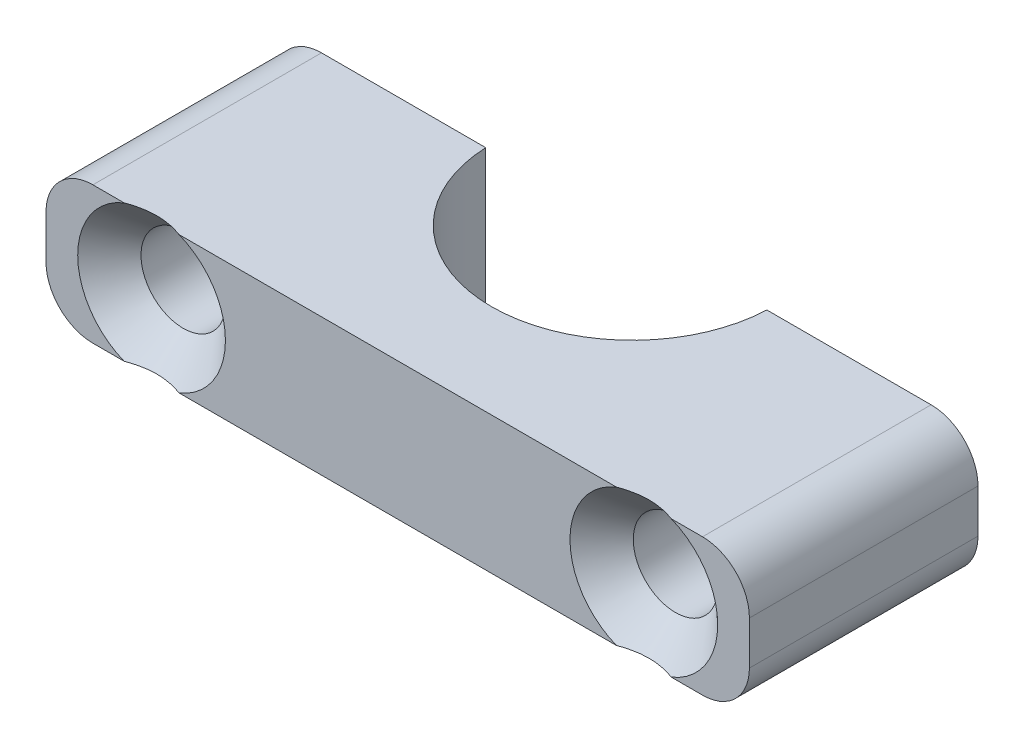
ISO-10303-21;
HEADER;
FILE_DESCRIPTION(('STEP AP214'),'2;1');
FILE_NAME('part.step','',(''),(''),'','','');
FILE_SCHEMA(('AUTOMOTIVE_DESIGN { 1 0 10303 214 1 1 1 1 }'));
ENDSEC;
DATA;
#1=APPLICATION_CONTEXT('core data for automotive mechanical design processes');
#2=APPLICATION_PROTOCOL_DEFINITION('international standard','automotive_design',2000,#1);
#3=PRODUCT_CONTEXT('',#1,'mechanical');
#4=PRODUCT('Part','Part','',(#3));
#5=PRODUCT_RELATED_PRODUCT_CATEGORY('part','',(#4));
#6=PRODUCT_DEFINITION_FORMATION('','',#4);
#7=PRODUCT_DEFINITION_CONTEXT('part definition',#1,'design');
#8=PRODUCT_DEFINITION('design','',#6,#7);
#9=PRODUCT_DEFINITION_SHAPE('','',#8);
#10=(LENGTH_UNIT() NAMED_UNIT(*) SI_UNIT(.MILLI.,.METRE.));
#11=(NAMED_UNIT(*) PLANE_ANGLE_UNIT() SI_UNIT($,.RADIAN.));
#12=(NAMED_UNIT(*) SI_UNIT($,.STERADIAN.) SOLID_ANGLE_UNIT());
#13=UNCERTAINTY_MEASURE_WITH_UNIT(LENGTH_MEASURE(1.E-05),#10,'distance_accuracy_value','');
#14=(GEOMETRIC_REPRESENTATION_CONTEXT(3) GLOBAL_UNCERTAINTY_ASSIGNED_CONTEXT((#13)) GLOBAL_UNIT_ASSIGNED_CONTEXT((#10,
#11,#12)) REPRESENTATION_CONTEXT('',''));
#15=CARTESIAN_POINT('',(0.,0.,0.));
#16=DIRECTION('',(0.,0.,1.));
#17=DIRECTION('',(1.,0.,0.));
#18=AXIS2_PLACEMENT_3D('',#15,#16,#17);
#19=CARTESIAN_POINT('',(0.,2.925,4.875));
#20=DIRECTION('',(0.,0.,1.));
#21=DIRECTION('',(1.,0.,0.));
#22=AXIS2_PLACEMENT_3D('',#19,#20,#21);
#23=PLANE('',#22);
#24=DIRECTION('',(0.,-1.,0.));
#25=VECTOR('',#24,1.);
#26=CARTESIAN_POINT('',(-15.,2.925,4.875));
#27=LINE('',#26,#25);
#28=CARTESIAN_POINT('',(-15.,0.925,4.875));
#29=VERTEX_POINT('',#28);
#30=CARTESIAN_POINT('',(-15.,-0.925,4.875));
#31=VERTEX_POINT('',#30);
#32=EDGE_CURVE('E279',#29,#31,#27,.T.);
#33=ORIENTED_EDGE('',*,*,#32,.T.);
#34=CARTESIAN_POINT('',(-13.,-0.925,4.875));
#35=DIRECTION('',(0.,0.,1.));
#36=DIRECTION('',(1.,0.,0.));
#37=AXIS2_PLACEMENT_3D('',#34,#35,#36);
#38=CIRCLE('',#37,2.);
#39=CARTESIAN_POINT('',(-13.,-2.925,4.875));
#40=VERTEX_POINT('',#39);
#41=EDGE_CURVE('E322',#31,#40,#38,.T.);
#42=ORIENTED_EDGE('',*,*,#41,.T.);
#43=DIRECTION('',(-1.,0.,0.));
#44=VECTOR('',#43,1.);
#45=CARTESIAN_POINT('',(0.,-2.925,4.875));
#46=LINE('',#45,#44);
#47=CARTESIAN_POINT('',(-11.6665289971794,-2.925,4.875));
#48=VERTEX_POINT('',#47);
#49=EDGE_CURVE('E161',#48,#40,#46,.T.);
#50=ORIENTED_EDGE('',*,*,#49,.F.);
#51=CARTESIAN_POINT('',(-10.4973947020705,0.,4.875));
#52=DIRECTION('',(0.,0.,1.));
#53=DIRECTION('',(1.,0.,0.));
#54=AXIS2_PLACEMENT_3D('',#51,#52,#53);
#55=CIRCLE('',#54,3.15);
#56=CARTESIAN_POINT('',(-11.6665289971794,2.925,4.875));
#57=VERTEX_POINT('',#56);
#58=EDGE_CURVE('E147',#57,#48,#55,.T.);
#59=ORIENTED_EDGE('',*,*,#58,.F.);
#60=DIRECTION('',(-1.,0.,0.));
#61=VECTOR('',#60,1.);
#62=CARTESIAN_POINT('',(0.,2.925,4.875));
#63=LINE('',#62,#61);
#64=CARTESIAN_POINT('',(-13.,2.925,4.875));
#65=VERTEX_POINT('',#64);
#66=EDGE_CURVE('E158',#57,#65,#63,.T.);
#67=ORIENTED_EDGE('',*,*,#66,.T.);
#68=CARTESIAN_POINT('',(-13.,0.925,4.875));
#69=DIRECTION('',(0.,0.,1.));
#70=DIRECTION('',(1.,0.,0.));
#71=AXIS2_PLACEMENT_3D('',#68,#69,#70);
#72=CIRCLE('',#71,2.);
#73=EDGE_CURVE('E320',#65,#29,#72,.T.);
#74=ORIENTED_EDGE('',*,*,#73,.T.);
#75=EDGE_LOOP('',(#33,#42,#50,#59,#67,#74));
#76=FACE_BOUND('',#75,.T.);
#77=ADVANCED_FACE('F41',(#76),#23,.T.);
#78=CARTESIAN_POINT('',(-9.32826040696145,-2.925,4.875));
#79=VERTEX_POINT('',#78);
#80=CARTESIAN_POINT('',(-9.32826040696146,2.925,4.875));
#81=VERTEX_POINT('',#80);
#82=EDGE_CURVE('E150',#79,#81,#55,.T.);
#83=ORIENTED_EDGE('',*,*,#82,.F.);
#84=CARTESIAN_POINT('',(9.32826040696145,-2.925,4.875));
#85=VERTEX_POINT('',#84);
#86=EDGE_CURVE('E265',#85,#79,#46,.T.);
#87=ORIENTED_EDGE('',*,*,#86,.F.);
#88=CARTESIAN_POINT('',(10.4973947020705,0.,4.875));
#89=DIRECTION('',(0.,0.,1.));
#90=DIRECTION('',(1.,0.,0.));
#91=AXIS2_PLACEMENT_3D('',#88,#89,#90);
#92=CIRCLE('',#91,3.15);
#93=CARTESIAN_POINT('',(9.32826040696146,2.925,4.875));
#94=VERTEX_POINT('',#93);
#95=EDGE_CURVE('E244',#94,#85,#92,.T.);
#96=ORIENTED_EDGE('',*,*,#95,.F.);
#97=EDGE_CURVE('E166',#94,#81,#63,.T.);
#98=ORIENTED_EDGE('',*,*,#97,.T.);
#99=EDGE_LOOP('',(#83,#87,#96,#98));
#100=FACE_BOUND('',#99,.T.);
#101=ADVANCED_FACE('F269',(#100),#23,.T.);
#102=CARTESIAN_POINT('',(0.,2.925,-5.125));
#103=DIRECTION('',(0.,-1.,0.));
#104=DIRECTION('',(0.,0.,-1.));
#105=AXIS2_PLACEMENT_3D('',#102,#103,#104);
#106=CYLINDRICAL_SURFACE('',#105,6.);
#107=CARTESIAN_POINT('',(0.,-2.925,-5.125));
#108=DIRECTION('',(0.,1.,0.));
#109=DIRECTION('',(0.,0.,1.));
#110=AXIS2_PLACEMENT_3D('',#107,#108,#109);
#111=CIRCLE('',#110,6.);
#112=CARTESIAN_POINT('',(-5.9947894041409,-2.925,-4.875));
#113=VERTEX_POINT('',#112);
#114=CARTESIAN_POINT('',(5.9947894041409,-2.925,-4.875));
#115=VERTEX_POINT('',#114);
#116=EDGE_CURVE('E199',#113,#115,#111,.T.);
#117=ORIENTED_EDGE('',*,*,#116,.F.);
#118=DIRECTION('',(0.,-1.,0.));
#119=VECTOR('',#118,1.);
#120=CARTESIAN_POINT('',(-5.9947894041409,2.925,-4.875));
#121=LINE('',#120,#119);
#122=CARTESIAN_POINT('',(-5.9947894041409,2.925,-4.875));
#123=VERTEX_POINT('',#122);
#124=EDGE_CURVE('E268',#123,#113,#121,.T.);
#125=ORIENTED_EDGE('',*,*,#124,.F.);
#126=CARTESIAN_POINT('',(0.,2.925,-5.125));
#127=DIRECTION('',(0.,1.,0.));
#128=DIRECTION('',(0.,0.,1.));
#129=AXIS2_PLACEMENT_3D('',#126,#127,#128);
#130=CIRCLE('',#129,6.);
#131=CARTESIAN_POINT('',(5.9947894041409,2.925,-4.875));
#132=VERTEX_POINT('',#131);
#133=EDGE_CURVE('E172',#123,#132,#130,.T.);
#134=ORIENTED_EDGE('',*,*,#133,.T.);
#135=DIRECTION('',(0.,-1.,0.));
#136=VECTOR('',#135,1.);
#137=CARTESIAN_POINT('',(5.9947894041409,2.925,-4.875));
#138=LINE('',#137,#136);
#139=EDGE_CURVE('E179',#132,#115,#138,.T.);
#140=ORIENTED_EDGE('',*,*,#139,.T.);
#141=EDGE_LOOP('',(#117,#125,#134,#140));
#142=FACE_BOUND('',#141,.T.);
#143=ADVANCED_FACE('F293',(#142),#106,.F.);
#144=CARTESIAN_POINT('',(0.,2.925,-4.875));
#145=DIRECTION('',(0.,0.,1.));
#146=DIRECTION('',(1.,0.,0.));
#147=AXIS2_PLACEMENT_3D('',#144,#145,#146);
#148=PLANE('',#147);
#149=CARTESIAN_POINT('',(-10.4973947020705,0.,-4.875));
#150=DIRECTION('',(0.,0.,1.));
#151=DIRECTION('',(1.,0.,0.));
#152=AXIS2_PLACEMENT_3D('',#149,#150,#151);
#153=CIRCLE('',#152,1.8);
#154=CARTESIAN_POINT('',(-8.69739470207045,0.,-4.875));
#155=VERTEX_POINT('',#154);
#156=EDGE_CURVE('E242',#155,#155,#153,.T.);
#157=ORIENTED_EDGE('',*,*,#156,.T.);
#158=EDGE_LOOP('',(#157));
#159=FACE_BOUND('',#158,.T.);
#160=DIRECTION('',(-1.,0.,0.));
#161=VECTOR('',#160,1.);
#162=CARTESIAN_POINT('',(0.,-2.925,-4.875));
#163=LINE('',#162,#161);
#164=CARTESIAN_POINT('',(-13.,-2.925,-4.875));
#165=VERTEX_POINT('',#164);
#166=EDGE_CURVE('E271',#113,#165,#163,.T.);
#167=ORIENTED_EDGE('',*,*,#166,.T.);
#168=CARTESIAN_POINT('',(-13.,-0.925,-4.875));
#169=DIRECTION('',(0.,0.,1.));
#170=DIRECTION('',(1.,0.,0.));
#171=AXIS2_PLACEMENT_3D('',#168,#169,#170);
#172=CIRCLE('',#171,2.);
#173=CARTESIAN_POINT('',(-15.,-0.925,-4.875));
#174=VERTEX_POINT('',#173);
#175=EDGE_CURVE('E314',#165,#174,#172,.F.);
#176=ORIENTED_EDGE('',*,*,#175,.T.);
#177=DIRECTION('',(0.,-1.,0.));
#178=VECTOR('',#177,1.);
#179=CARTESIAN_POINT('',(-15.,2.925,-4.875));
#180=LINE('',#179,#178);
#181=CARTESIAN_POINT('',(-15.,0.925,-4.875));
#182=VERTEX_POINT('',#181);
#183=EDGE_CURVE('E281',#182,#174,#180,.T.);
#184=ORIENTED_EDGE('',*,*,#183,.F.);
#185=CARTESIAN_POINT('',(-13.,0.925,-4.875));
#186=DIRECTION('',(0.,0.,1.));
#187=DIRECTION('',(1.,0.,0.));
#188=AXIS2_PLACEMENT_3D('',#185,#186,#187);
#189=CIRCLE('',#188,2.);
#190=CARTESIAN_POINT('',(-13.,2.925,-4.875));
#191=VERTEX_POINT('',#190);
#192=EDGE_CURVE('E312',#182,#191,#189,.F.);
#193=ORIENTED_EDGE('',*,*,#192,.T.);
#194=DIRECTION('',(-1.,0.,0.));
#195=VECTOR('',#194,1.);
#196=CARTESIAN_POINT('',(0.,2.925,-4.875));
#197=LINE('',#196,#195);
#198=EDGE_CURVE('E167',#123,#191,#197,.T.);
#199=ORIENTED_EDGE('',*,*,#198,.F.);
#200=ORIENTED_EDGE('',*,*,#124,.T.);
#201=EDGE_LOOP('',(#167,#176,#184,#193,#199,#200));
#202=FACE_BOUND('',#201,.T.);
#203=ADVANCED_FACE('F286',(#159,#202),#148,.F.);
#204=CARTESIAN_POINT('',(-15.,2.925,0.));
#205=DIRECTION('',(-1.,0.,0.));
#206=DIRECTION('',(0.,0.,1.));
#207=AXIS2_PLACEMENT_3D('',#204,#205,#206);
#208=PLANE('',#207);
#209=ORIENTED_EDGE('',*,*,#183,.T.);
#210=DIRECTION('',(0.,0.,-1.));
#211=VECTOR('',#210,1.);
#212=CARTESIAN_POINT('',(-15.,-0.925,4.875));
#213=LINE('',#212,#211);
#214=EDGE_CURVE('E63',#174,#31,#213,.F.);
#215=ORIENTED_EDGE('',*,*,#214,.T.);
#216=ORIENTED_EDGE('',*,*,#32,.F.);
#217=DIRECTION('',(0.,0.,-1.));
#218=VECTOR('',#217,1.);
#219=CARTESIAN_POINT('',(-15.,0.925,0.));
#220=LINE('',#219,#218);
#221=EDGE_CURVE('E316',#29,#182,#220,.T.);
#222=ORIENTED_EDGE('',*,*,#221,.T.);
#223=EDGE_LOOP('',(#209,#215,#216,#222));
#224=FACE_BOUND('',#223,.T.);
#225=ADVANCED_FACE('F327',(#224),#208,.T.);
#226=CARTESIAN_POINT('',(13.,-2.925,4.875));
#227=VERTEX_POINT('',#226);
#228=CARTESIAN_POINT('',(11.6665289971794,-2.925,4.875));
#229=VERTEX_POINT('',#228);
#230=EDGE_CURVE('E267',#227,#229,#46,.T.);
#231=ORIENTED_EDGE('',*,*,#230,.F.);
#232=CARTESIAN_POINT('',(13.,-0.925,4.875));
#233=DIRECTION('',(0.,0.,1.));
#234=DIRECTION('',(1.,0.,0.));
#235=AXIS2_PLACEMENT_3D('',#232,#233,#234);
#236=CIRCLE('',#235,2.);
#237=CARTESIAN_POINT('',(15.,-0.925,4.875));
#238=VERTEX_POINT('',#237);
#239=EDGE_CURVE('E303',#227,#238,#236,.T.);
#240=ORIENTED_EDGE('',*,*,#239,.T.);
#241=DIRECTION('',(0.,-1.,0.));
#242=VECTOR('',#241,1.);
#243=CARTESIAN_POINT('',(15.,2.925,4.875));
#244=LINE('',#243,#242);
#245=CARTESIAN_POINT('',(15.,0.925,4.875));
#246=VERTEX_POINT('',#245);
#247=EDGE_CURVE('E276',#246,#238,#244,.T.);
#248=ORIENTED_EDGE('',*,*,#247,.F.);
#249=CARTESIAN_POINT('',(13.,0.925,4.875));
#250=DIRECTION('',(0.,0.,1.));
#251=DIRECTION('',(1.,0.,0.));
#252=AXIS2_PLACEMENT_3D('',#249,#250,#251);
#253=CIRCLE('',#252,2.);
#254=CARTESIAN_POINT('',(13.,2.925,4.875));
#255=VERTEX_POINT('',#254);
#256=EDGE_CURVE('E304',#246,#255,#253,.T.);
#257=ORIENTED_EDGE('',*,*,#256,.T.);
#258=CARTESIAN_POINT('',(11.6665289971794,2.925,4.875));
#259=VERTEX_POINT('',#258);
#260=EDGE_CURVE('E169',#255,#259,#63,.T.);
#261=ORIENTED_EDGE('',*,*,#260,.T.);
#262=EDGE_CURVE('E241',#229,#259,#92,.T.);
#263=ORIENTED_EDGE('',*,*,#262,.F.);
#264=EDGE_LOOP('',(#231,#240,#248,#257,#261,#263));
#265=FACE_BOUND('',#264,.T.);
#266=ADVANCED_FACE('F338',(#265),#23,.T.);
#267=CARTESIAN_POINT('',(15.,2.925,0.));
#268=DIRECTION('',(-1.,0.,0.));
#269=DIRECTION('',(0.,0.,1.));
#270=AXIS2_PLACEMENT_3D('',#267,#268,#269);
#271=PLANE('',#270);
#272=ORIENTED_EDGE('',*,*,#247,.T.);
#273=DIRECTION('',(0.,0.,-1.));
#274=VECTOR('',#273,1.);
#275=CARTESIAN_POINT('',(15.,-0.925,0.));
#276=LINE('',#275,#274);
#277=CARTESIAN_POINT('',(15.,-0.925,-4.875));
#278=VERTEX_POINT('',#277);
#279=EDGE_CURVE('E357',#238,#278,#276,.T.);
#280=ORIENTED_EDGE('',*,*,#279,.T.);
#281=DIRECTION('',(0.,-1.,0.));
#282=VECTOR('',#281,1.);
#283=CARTESIAN_POINT('',(15.,2.925,-4.875));
#284=LINE('',#283,#282);
#285=CARTESIAN_POINT('',(15.,0.925,-4.875));
#286=VERTEX_POINT('',#285);
#287=EDGE_CURVE('E184',#286,#278,#284,.T.);
#288=ORIENTED_EDGE('',*,*,#287,.F.);
#289=DIRECTION('',(0.,0.,-1.));
#290=VECTOR('',#289,1.);
#291=CARTESIAN_POINT('',(15.,0.925,4.875));
#292=LINE('',#291,#290);
#293=EDGE_CURVE('E153',#286,#246,#292,.F.);
#294=ORIENTED_EDGE('',*,*,#293,.T.);
#295=EDGE_LOOP('',(#272,#280,#288,#294));
#296=FACE_BOUND('',#295,.T.);
#297=ADVANCED_FACE('F345',(#296),#271,.F.);
#298=CARTESIAN_POINT('',(10.4973947020705,0.,-4.875));
#299=DIRECTION('',(0.,0.,1.));
#300=DIRECTION('',(1.,0.,0.));
#301=AXIS2_PLACEMENT_3D('',#298,#299,#300);
#302=CIRCLE('',#301,1.8);
#303=CARTESIAN_POINT('',(12.2973947020704,0.,-4.875));
#304=VERTEX_POINT('',#303);
#305=EDGE_CURVE('E200',#304,#304,#302,.T.);
#306=ORIENTED_EDGE('',*,*,#305,.T.);
#307=EDGE_LOOP('',(#306));
#308=FACE_BOUND('',#307,.T.);
#309=ORIENTED_EDGE('',*,*,#287,.T.);
#310=CARTESIAN_POINT('',(13.,-0.925,-4.875));
#311=DIRECTION('',(0.,0.,1.));
#312=DIRECTION('',(1.,0.,0.));
#313=AXIS2_PLACEMENT_3D('',#310,#311,#312);
#314=CIRCLE('',#313,2.);
#315=CARTESIAN_POINT('',(13.,-2.925,-4.875));
#316=VERTEX_POINT('',#315);
#317=EDGE_CURVE('E295',#278,#316,#314,.F.);
#318=ORIENTED_EDGE('',*,*,#317,.T.);
#319=EDGE_CURVE('E190',#316,#115,#163,.T.);
#320=ORIENTED_EDGE('',*,*,#319,.T.);
#321=ORIENTED_EDGE('',*,*,#139,.F.);
#322=CARTESIAN_POINT('',(13.,2.925,-4.875));
#323=VERTEX_POINT('',#322);
#324=EDGE_CURVE('E174',#323,#132,#197,.T.);
#325=ORIENTED_EDGE('',*,*,#324,.F.);
#326=CARTESIAN_POINT('',(13.,0.925,-4.875));
#327=DIRECTION('',(0.,0.,1.));
#328=DIRECTION('',(1.,0.,0.));
#329=AXIS2_PLACEMENT_3D('',#326,#327,#328);
#330=CIRCLE('',#329,2.);
#331=EDGE_CURVE('E355',#323,#286,#330,.F.);
#332=ORIENTED_EDGE('',*,*,#331,.T.);
#333=EDGE_LOOP('',(#309,#318,#320,#321,#325,#332));
#334=FACE_BOUND('',#333,.T.);
#335=ADVANCED_FACE('F210',(#308,#334),#148,.F.);
#336=CARTESIAN_POINT('',(0.,2.925,0.));
#337=DIRECTION('',(0.,1.,0.));
#338=DIRECTION('',(0.,0.,1.));
#339=AXIS2_PLACEMENT_3D('',#336,#337,#338);
#340=PLANE('',#339);
#341=ORIENTED_EDGE('',*,*,#260,.F.);
#342=DIRECTION('',(0.,0.,-1.));
#343=VECTOR('',#342,1.);
#344=CARTESIAN_POINT('',(13.,2.925,-4.875));
#345=LINE('',#344,#343);
#346=EDGE_CURVE('E11',#255,#323,#345,.T.);
#347=ORIENTED_EDGE('',*,*,#346,.T.);
#348=ORIENTED_EDGE('',*,*,#324,.T.);
#349=ORIENTED_EDGE('',*,*,#133,.F.);
#350=ORIENTED_EDGE('',*,*,#198,.T.);
#351=DIRECTION('',(0.,0.,-1.));
#352=VECTOR('',#351,1.);
#353=CARTESIAN_POINT('',(-13.,2.925,0.));
#354=LINE('',#353,#352);
#355=EDGE_CURVE('E49',#191,#65,#354,.F.);
#356=ORIENTED_EDGE('',*,*,#355,.T.);
#357=ORIENTED_EDGE('',*,*,#66,.F.);
#358=CARTESIAN_POINT('',(-20.1638617269608,2.925,11.8243172909505));
#359=CARTESIAN_POINT('',(-19.9288632604921,2.925,11.5994111528501));
#360=CARTESIAN_POINT('',(-19.6935397841159,2.925,11.3748428805711));
#361=CARTESIAN_POINT('',(-19.2220260346316,2.925,10.9265954540933));
#362=CARTESIAN_POINT('',(-18.9858357199421,2.925,10.7029163436479));
#363=CARTESIAN_POINT('',(-18.5117669537423,2.925,10.2560912199909));
#364=CARTESIAN_POINT('',(-18.273885687203,2.925,10.032948190719));
#365=CARTESIAN_POINT('',(-17.7967617830354,2.925,9.58813700564696));
#366=CARTESIAN_POINT('',(-17.5575191919535,2.925,9.36646879997531));
#367=CARTESIAN_POINT('',(-17.049002203027,2.925,8.89911822437006));
#368=CARTESIAN_POINT('',(-16.7795051265241,2.925,8.65367782930352));
#369=CARTESIAN_POINT('',(-16.2373864034346,2.925,8.16619275715808));
#370=CARTESIAN_POINT('',(-15.9647644024711,2.925,7.92414847227219));
#371=CARTESIAN_POINT('',(-15.5526809423342,2.925,7.56512524192236));
#372=CARTESIAN_POINT('',(-15.4149026998101,2.925,7.44621528468488));
#373=CARTESIAN_POINT('',(-15.1379709533055,2.925,7.2100095261448));
#374=CARTESIAN_POINT('',(-14.9988174742612,2.925,7.09271369566617));
#375=CARTESIAN_POINT('',(-14.7188385630684,2.925,6.86018601345687));
#376=CARTESIAN_POINT('',(-14.5780134564144,2.925,6.74495377052721));
#377=CARTESIAN_POINT('',(-14.2942457993271,2.925,6.51713220866743));
#378=CARTESIAN_POINT('',(-14.1513033748174,2.925,6.40454273358481));
#379=CARTESIAN_POINT('',(-13.9077959146721,2.925,6.21748699860817));
#380=CARTESIAN_POINT('',(-13.8079406118944,2.925,6.14209779982963));
#381=CARTESIAN_POINT('',(-13.6067131129074,2.925,5.99335888904278));
#382=CARTESIAN_POINT('',(-13.5053408706088,2.925,5.9200092391967));
#383=CARTESIAN_POINT('',(-13.3005974677704,2.925,5.77571401040024));
#384=CARTESIAN_POINT('',(-13.1972227977938,2.925,5.70477339329216));
#385=CARTESIAN_POINT('',(-12.9883236681888,2.925,5.56612546006493));
#386=CARTESIAN_POINT('',(-12.8827993121821,2.925,5.49841798862154));
#387=CARTESIAN_POINT('',(-12.671500179455,2.925,5.36856448491293));
#388=CARTESIAN_POINT('',(-12.56578019262,2.925,5.30632983449291));
#389=CARTESIAN_POINT('',(-12.3514364926902,2.925,5.18696028962611));
#390=CARTESIAN_POINT('',(-12.2428120230385,2.925,5.1298267410611));
#391=CARTESIAN_POINT('',(-12.0226613296974,2.925,5.0224022460178));
#392=CARTESIAN_POINT('',(-11.9111463757807,2.925,4.97208843298285));
#393=CARTESIAN_POINT('',(-11.6846309433868,2.925,4.88007042980693));
#394=CARTESIAN_POINT('',(-11.5696329116953,2.925,4.83836034954314));
#395=CARTESIAN_POINT('',(-11.3802379936758,2.925,4.77954795528082));
#396=CARTESIAN_POINT('',(-11.3068791454676,2.925,4.75909674241437));
#397=CARTESIAN_POINT('',(-11.1589598754065,2.925,4.72302452410039));
#398=CARTESIAN_POINT('',(-11.084399318972,2.925,4.7074040636689));
#399=CARTESIAN_POINT('',(-10.9345323744139,2.925,4.68156616491481));
#400=CARTESIAN_POINT('',(-10.8592283536188,2.925,4.67133514214556));
#401=CARTESIAN_POINT('',(-10.7080619798182,2.925,4.65661154985885));
#402=CARTESIAN_POINT('',(-10.6321996565515,2.925,4.65211867688316));
#403=CARTESIAN_POINT('',(-10.4649405927198,2.925,4.64875672399624));
#404=CARTESIAN_POINT('',(-10.3735138954252,2.925,4.65121311210065));
#405=CARTESIAN_POINT('',(-10.1912818141115,2.925,4.66456855572726));
#406=CARTESIAN_POINT('',(-10.1004765257299,2.925,4.67546888258272));
#407=CARTESIAN_POINT('',(-9.91979733801802,2.925,4.7051449435526));
#408=CARTESIAN_POINT('',(-9.82992876987096,2.925,4.72395271877111));
#409=CARTESIAN_POINT('',(-9.65195501395681,2.925,4.76851229265643));
#410=CARTESIAN_POINT('',(-9.56385000212624,2.925,4.79426478047163));
#411=CARTESIAN_POINT('',(-9.29776871461828,2.925,4.88191797489519));
#412=CARTESIAN_POINT('',(-9.12290163238099,2.925,4.95331833230299));
#413=CARTESIAN_POINT('',(-8.86665018730206,2.925,5.07302168325475));
#414=CARTESIAN_POINT('',(-8.78215689657698,2.925,5.11507336078386));
#415=CARTESIAN_POINT('',(-8.61498411777024,2.925,5.20264634350075));
#416=CARTESIAN_POINT('',(-8.53230436297358,2.925,5.24816713402321));
#417=CARTESIAN_POINT('',(-8.36742214998953,2.925,5.34270390407384));
#418=CARTESIAN_POINT('',(-8.28524308926093,2.925,5.39176029613765));
#419=CARTESIAN_POINT('',(-8.12236280095062,2.925,5.49226637786239));
#420=CARTESIAN_POINT('',(-8.04166160606486,2.925,5.54371612038431));
#421=CARTESIAN_POINT('',(-7.88162830680673,2.925,5.64854498923636));
#422=CARTESIAN_POINT('',(-7.80229505782381,2.925,5.70192237406951));
#423=CARTESIAN_POINT('',(-7.64476780994227,2.925,5.81032109271205));
#424=CARTESIAN_POINT('',(-7.56657376469208,2.925,5.86534235935623));
#425=CARTESIAN_POINT('',(-7.30985007501627,2.925,6.04939760526584));
#426=CARTESIAN_POINT('',(-7.1334398574325,2.925,6.18138871300366));
#427=CARTESIAN_POINT('',(-6.78446475127718,2.925,6.45037573684664));
#428=CARTESIAN_POINT('',(-6.61190059575835,2.925,6.58737259412545));
#429=CARTESIAN_POINT('',(-6.26959469074549,2.925,6.86502918968308));
#430=CARTESIAN_POINT('',(-6.0998545527201,2.925,7.00569090920042));
#431=CARTESIAN_POINT('',(-5.76260943026667,2.925,7.28967066136398));
#432=CARTESIAN_POINT('',(-5.59510451828829,2.925,7.43298877975324));
#433=CARTESIAN_POINT('',(-5.26142166047634,2.925,7.72200507731208));
#434=CARTESIAN_POINT('',(-5.09524814270571,2.925,7.86770835964788));
#435=CARTESIAN_POINT('',(-4.76429601931663,2.925,8.16069323207717));
#436=CARTESIAN_POINT('',(-4.59951743606165,2.925,8.30797484738893));
#437=CARTESIAN_POINT('',(-4.10696741047269,2.925,8.75156957355082));
#438=CARTESIAN_POINT('',(-3.7808647354061,2.925,9.04973475140379));
#439=CARTESIAN_POINT('',(-3.17117069403107,2.925,9.6127985890347));
#440=CARTESIAN_POINT('',(-2.88723700110691,2.925,9.87732816891171));
#441=CARTESIAN_POINT('',(-2.32104921357395,2.925,10.408234873108));
#442=CARTESIAN_POINT('',(-2.03879529045755,2.925,10.6746121802528));
#443=CARTESIAN_POINT('',(-1.47690207261045,2.925,11.2074565740513));
#444=CARTESIAN_POINT('',(-1.19725672530903,2.925,11.4739172868402));
#445=CARTESIAN_POINT('',(-0.639000204739919,2.925,12.007854140183));
#446=CARTESIAN_POINT('',(-0.360388912871113,2.925,12.2753301566913));
#447=CARTESIAN_POINT('',(-0.0821428402793567,2.925,12.5431835972839));
#448=B_SPLINE_CURVE_WITH_KNOTS('',3,(#358,#359,#360,#361,#362,#363,#364,#365,#366,#367,#368,
#369,#370,#371,#372,#373,#374,#375,#376,#377,#378,#379,#380,#381,#382,#383,#384,#385,#386,#387,
#388,#389,#390,#391,#392,#393,#394,#395,#396,#397,#398,#399,#400,#401,#402,#403,#404,#405,#406,
#407,#408,#409,#410,#411,#412,#413,#414,#415,#416,#417,#418,#419,#420,#421,#422,#423,#424,#425,
#426,#427,#428,#429,#430,#431,#432,#433,#434,#435,#436,#437,#438,#439,#440,#441,#442,#443,#444,
#445,#446,#447),.UNSPECIFIED.,.F.,.F.,(4,2,2,2,2,2,2,2,2,2,2,2,2,2,2,2,2,2,2,2,2,2,2,2,2,2,2,2,
2,2,2,2,2,2,2,2,2,2,2,2,2,2,2,2,4),(0.,0.975841328237367,1.95173009503323,2.93020521997401,
3.9086470875512,5.00216841685813,6.0958150067887,6.64179275113279,7.18776061369843,
7.73362385620569,8.27945476383817,8.65478972484988,9.03013611296613,9.40621372775191,
9.78227325709704,10.1501983855229,10.51822030272,10.8849759905082,11.2514797575721,
11.4798106929117,11.7081673796558,11.935945689787,12.1637119535152,12.4376747404091,
12.7116787836088,12.986803961888,13.2619564518644,13.8269939938008,14.1100996237305,
14.3931633345687,14.6802413678628,14.967325744749,15.2541569478231,15.5409764476197,
16.2017937414428,16.8627359270302,17.5240431544158,18.1853717647272,18.84837312778,
19.5113850999651,20.8369431715911,22.0011294635553,23.1654326389052,24.3242333131856,
25.4828966955069),.UNSPECIFIED.);
#449=EDGE_CURVE('E144',#81,#57,#448,.F.);
#450=ORIENTED_EDGE('',*,*,#449,.F.);
#451=ORIENTED_EDGE('',*,*,#97,.F.);
#452=CARTESIAN_POINT('',(0.83092767718013,2.925,11.8243172909505));
#453=CARTESIAN_POINT('',(1.06592614364881,2.925,11.5994111528501));
#454=CARTESIAN_POINT('',(1.30124962002498,2.925,11.3748428805711));
#455=CARTESIAN_POINT('',(1.77276336950927,2.925,10.9265954540933));
#456=CARTESIAN_POINT('',(2.00895368419883,2.925,10.7029163436479));
#457=CARTESIAN_POINT('',(2.48302245039858,2.925,10.2560912199909));
#458=CARTESIAN_POINT('',(2.72090371693793,2.925,10.032948190719));
#459=CARTESIAN_POINT('',(3.19802762110554,2.925,9.58813700564696));
#460=CARTESIAN_POINT('',(3.43727021218739,2.925,9.36646879997531));
#461=CARTESIAN_POINT('',(3.9457872011139,2.925,8.89911822437005));
#462=CARTESIAN_POINT('',(4.21528427761681,2.925,8.65367782930351));
#463=CARTESIAN_POINT('',(4.75740300070628,2.925,8.16619275715808));
#464=CARTESIAN_POINT('',(5.03002500166979,2.925,7.92414847227218));
#465=CARTESIAN_POINT('',(5.44210846180667,2.925,7.56512524192235));
#466=CARTESIAN_POINT('',(5.57988670433077,2.925,7.44621528468487));
#467=CARTESIAN_POINT('',(5.85681845083545,2.925,7.21000952614479));
#468=CARTESIAN_POINT('',(5.99597192987972,2.925,7.09271369566616));
#469=CARTESIAN_POINT('',(6.27595084107248,2.925,6.86018601345685));
#470=CARTESIAN_POINT('',(6.41677594772649,2.925,6.7449537705272));
#471=CARTESIAN_POINT('',(6.70054360481378,2.925,6.51713220866741));
#472=CARTESIAN_POINT('',(6.84348602932355,2.925,6.4045427335848));
#473=CARTESIAN_POINT('',(7.08699348946882,2.925,6.21748699860816));
#474=CARTESIAN_POINT('',(7.18684879224655,2.925,6.14209779982962));
#475=CARTESIAN_POINT('',(7.38807629123351,2.925,5.99335888904277));
#476=CARTESIAN_POINT('',(7.48944853353213,2.925,5.92000923919669));
#477=CARTESIAN_POINT('',(7.6941919363705,2.925,5.77571401040024));
#478=CARTESIAN_POINT('',(7.79756660634713,2.925,5.70477339329215));
#479=CARTESIAN_POINT('',(8.00646573595211,2.925,5.56612546006493));
#480=CARTESIAN_POINT('',(8.11199009195877,2.925,5.49841798862154));
#481=CARTESIAN_POINT('',(8.32328922468594,2.925,5.36856448491292));
#482=CARTESIAN_POINT('',(8.42900921152092,2.925,5.3063298344929));
#483=CARTESIAN_POINT('',(8.64335291145074,2.925,5.1869602896261));
#484=CARTESIAN_POINT('',(8.75197738110241,2.925,5.1298267410611));
#485=CARTESIAN_POINT('',(8.97212807444354,2.925,5.02240224601779));
#486=CARTESIAN_POINT('',(9.0836430283602,2.925,4.97208843298284));
#487=CARTESIAN_POINT('',(9.31015846075412,2.925,4.88007042980692));
#488=CARTESIAN_POINT('',(9.42515649244557,2.925,4.83836034954314));
#489=CARTESIAN_POINT('',(9.6145514104651,2.925,4.77954795528082));
#490=CARTESIAN_POINT('',(9.68791025867332,2.925,4.75909674241437));
#491=CARTESIAN_POINT('',(9.83582952873439,2.925,4.72302452410039));
#492=CARTESIAN_POINT('',(9.9103900851689,2.925,4.7074040636689));
#493=CARTESIAN_POINT('',(10.060257029727,2.925,4.68156616491481));
#494=CARTESIAN_POINT('',(10.1355610505221,2.925,4.67133514214556));
#495=CARTESIAN_POINT('',(10.2867274243227,2.925,4.65661154985885));
#496=CARTESIAN_POINT('',(10.3625897475894,2.925,4.65211867688316));
#497=CARTESIAN_POINT('',(10.5298488114211,2.925,4.64875672399624));
#498=CARTESIAN_POINT('',(10.6212755087157,2.925,4.65121311210065));
#499=CARTESIAN_POINT('',(10.8035075900294,2.925,4.66456855572726));
#500=CARTESIAN_POINT('',(10.894312878411,2.925,4.67546888258272));
#501=CARTESIAN_POINT('',(11.0749920661229,2.925,4.7051449435526));
#502=CARTESIAN_POINT('',(11.1648606342699,2.925,4.72395271877111));
#503=CARTESIAN_POINT('',(11.3428343901841,2.925,4.76851229265643));
#504=CARTESIAN_POINT('',(11.4309394020147,2.925,4.79426478047163));
#505=CARTESIAN_POINT('',(11.6970206895226,2.925,4.88191797489519));
#506=CARTESIAN_POINT('',(11.8718877717599,2.925,4.95331833230299));
#507=CARTESIAN_POINT('',(12.1281392168388,2.925,5.07302168325475));
#508=CARTESIAN_POINT('',(12.2126325075639,2.925,5.11507336078386));
#509=CARTESIAN_POINT('',(12.3798052863707,2.925,5.20264634350075));
#510=CARTESIAN_POINT('',(12.4624850411673,2.925,5.24816713402321));
#511=CARTESIAN_POINT('',(12.6273672541514,2.925,5.34270390407384));
#512=CARTESIAN_POINT('',(12.70954631488,2.925,5.39176029613765));
#513=CARTESIAN_POINT('',(12.8724266031903,2.925,5.49226637786239));
#514=CARTESIAN_POINT('',(12.953127798076,2.925,5.54371612038431));
#515=CARTESIAN_POINT('',(13.1131610973342,2.925,5.64854498923636));
#516=CARTESIAN_POINT('',(13.1924943463171,2.925,5.70192237406951));
#517=CARTESIAN_POINT('',(13.3500215941986,2.925,5.81032109271205));
#518=CARTESIAN_POINT('',(13.4282156394488,2.925,5.86534235935623));
#519=CARTESIAN_POINT('',(13.6849393291246,2.925,6.04939760526584));
#520=CARTESIAN_POINT('',(13.8613495467084,2.925,6.18138871300366));
#521=CARTESIAN_POINT('',(14.2103246528637,2.925,6.45037573684663));
#522=CARTESIAN_POINT('',(14.3828888083825,2.925,6.58737259412544));
#523=CARTESIAN_POINT('',(14.7251947133954,2.925,6.86502918968308));
#524=CARTESIAN_POINT('',(14.8949348514208,2.925,7.00569090920042));
#525=CARTESIAN_POINT('',(15.2321799738742,2.925,7.28967066136398));
#526=CARTESIAN_POINT('',(15.3996848858526,2.925,7.43298877975324));
#527=CARTESIAN_POINT('',(15.7333677436646,2.925,7.72200507731208));
#528=CARTESIAN_POINT('',(15.8995412614352,2.925,7.86770835964788));
#529=CARTESIAN_POINT('',(16.2304933848243,2.925,8.16069323207717));
#530=CARTESIAN_POINT('',(16.3952719680792,2.925,8.30797484738893));
#531=CARTESIAN_POINT('',(16.8878219936682,2.925,8.75156957355081));
#532=CARTESIAN_POINT('',(17.2139246687348,2.925,9.04973475140379));
#533=CARTESIAN_POINT('',(17.8236187101098,2.925,9.61279858903469));
#534=CARTESIAN_POINT('',(18.107552403034,2.925,9.8773281689117));
#535=CARTESIAN_POINT('',(18.6737401905669,2.925,10.408234873108));
#536=CARTESIAN_POINT('',(18.9559941136833,2.925,10.6746121802528));
#537=CARTESIAN_POINT('',(19.5178873315304,2.925,11.2074565740513));
#538=CARTESIAN_POINT('',(19.7975326788319,2.925,11.4739172868402));
#539=CARTESIAN_POINT('',(20.355789199401,2.925,12.007854140183));
#540=CARTESIAN_POINT('',(20.6344004912698,2.925,12.2753301566912));
#541=CARTESIAN_POINT('',(20.9126465638615,2.925,12.5431835972839));
#542=B_SPLINE_CURVE_WITH_KNOTS('',3,(#452,#453,#454,#455,#456,#457,#458,#459,#460,#461,#462,
#463,#464,#465,#466,#467,#468,#469,#470,#471,#472,#473,#474,#475,#476,#477,#478,#479,#480,#481,
#482,#483,#484,#485,#486,#487,#488,#489,#490,#491,#492,#493,#494,#495,#496,#497,#498,#499,#500,
#501,#502,#503,#504,#505,#506,#507,#508,#509,#510,#511,#512,#513,#514,#515,#516,#517,#518,#519,
#520,#521,#522,#523,#524,#525,#526,#527,#528,#529,#530,#531,#532,#533,#534,#535,#536,#537,#538,
#539,#540,#541),.UNSPECIFIED.,.F.,.F.,(4,2,2,2,2,2,2,2,2,2,2,2,2,2,2,2,2,2,2,2,2,2,2,2,2,2,2,2,
2,2,2,2,2,2,2,2,2,2,2,2,2,2,2,2,4),(0.,0.975841328237371,1.95173009503324,2.93020521997401,
3.90864708755121,5.00216841685814,6.09581500678872,6.64179275113281,7.18776061369845,
7.73362385620572,8.27945476383819,8.6547897248499,9.03013611296614,9.40621372775192,
9.78227325709705,10.1501983855229,10.51822030272,10.8849759905082,11.2514797575721,
11.4798106929117,11.7081673796558,11.935945689787,12.1637119535152,12.4376747404091,
12.7116787836088,12.986803961888,13.2619564518644,13.8269939938008,14.1100996237305,
14.3931633345687,14.6802413678628,14.967325744749,15.2541569478231,15.5409764476197,
16.2017937414428,16.8627359270302,17.5240431544158,18.1853717647272,18.84837312778,
19.5113850999651,20.8369431715911,22.0011294635553,23.1654326389052,24.3242333131856,
25.4828966955069),.UNSPECIFIED.);
#543=EDGE_CURVE('E191',#259,#94,#542,.F.);
#544=ORIENTED_EDGE('',*,*,#543,.F.);
#545=EDGE_LOOP('',(#341,#347,#348,#349,#350,#356,#357,#450,#451,#544));
#546=FACE_BOUND('',#545,.T.);
#547=ADVANCED_FACE('F165',(#546),#340,.T.);
#548=CARTESIAN_POINT('',(0.,-2.925,0.));
#549=DIRECTION('',(0.,1.,0.));
#550=DIRECTION('',(0.,0.,1.));
#551=AXIS2_PLACEMENT_3D('',#548,#549,#550);
#552=PLANE('',#551);
#553=ORIENTED_EDGE('',*,*,#319,.F.);
#554=DIRECTION('',(0.,0.,-1.));
#555=VECTOR('',#554,1.);
#556=CARTESIAN_POINT('',(13.,-2.925,0.));
#557=LINE('',#556,#555);
#558=EDGE_CURVE('E297',#316,#227,#557,.F.);
#559=ORIENTED_EDGE('',*,*,#558,.T.);
#560=ORIENTED_EDGE('',*,*,#230,.T.);
#561=CARTESIAN_POINT('',(0.830927677180124,-2.925,11.8243172909505));
#562=CARTESIAN_POINT('',(1.06592614364881,-2.925,11.5994111528501));
#563=CARTESIAN_POINT('',(1.30124962002498,-2.925,11.3748428805711));
#564=CARTESIAN_POINT('',(1.77276336950926,-2.925,10.9265954540933));
#565=CARTESIAN_POINT('',(2.00895368419883,-2.925,10.702916343648));
#566=CARTESIAN_POINT('',(2.48302245039858,-2.925,10.256091219991));
#567=CARTESIAN_POINT('',(2.72090371693792,-2.925,10.032948190719));
#568=CARTESIAN_POINT('',(3.19802762110553,-2.925,9.58813700564696));
#569=CARTESIAN_POINT('',(3.43727021218738,-2.925,9.36646879997532));
#570=CARTESIAN_POINT('',(3.94578720111389,-2.925,8.89911822437006));
#571=CARTESIAN_POINT('',(4.2152842776168,-2.925,8.65367782930352));
#572=CARTESIAN_POINT('',(4.75740300070627,-2.925,8.16619275715809));
#573=CARTESIAN_POINT('',(5.03002500166978,-2.925,7.92414847227219));
#574=CARTESIAN_POINT('',(5.44210846180666,-2.925,7.56512524192236));
#575=CARTESIAN_POINT('',(5.57988670433076,-2.925,7.44621528468488));
#576=CARTESIAN_POINT('',(5.85681845083544,-2.925,7.2100095261448));
#577=CARTESIAN_POINT('',(5.99597192987971,-2.925,7.09271369566617));
#578=CARTESIAN_POINT('',(6.27595084107247,-2.925,6.86018601345686));
#579=CARTESIAN_POINT('',(6.41677594772648,-2.925,6.74495377052721));
#580=CARTESIAN_POINT('',(6.70054360481377,-2.925,6.51713220866742));
#581=CARTESIAN_POINT('',(6.84348602932354,-2.925,6.40454273358481));
#582=CARTESIAN_POINT('',(7.08699348946881,-2.925,6.21748699860817));
#583=CARTESIAN_POINT('',(7.18684879224654,-2.925,6.14209779982963));
#584=CARTESIAN_POINT('',(7.3880762912335,-2.925,5.99335888904278));
#585=CARTESIAN_POINT('',(7.48944853353212,-2.925,5.9200092391967));
#586=CARTESIAN_POINT('',(7.69419193637049,-2.925,5.77571401040024));
#587=CARTESIAN_POINT('',(7.79756660634712,-2.925,5.70477339329216));
#588=CARTESIAN_POINT('',(8.0064657359521,-2.925,5.56612546006493));
#589=CARTESIAN_POINT('',(8.11199009195876,-2.925,5.49841798862154));
#590=CARTESIAN_POINT('',(8.32328922468593,-2.925,5.36856448491293));
#591=CARTESIAN_POINT('',(8.42900921152091,-2.925,5.30632983449291));
#592=CARTESIAN_POINT('',(8.64335291145073,-2.925,5.18696028962611));
#593=CARTESIAN_POINT('',(8.7519773811024,-2.925,5.1298267410611));
#594=CARTESIAN_POINT('',(8.97212807444353,-2.925,5.02240224601779));
#595=CARTESIAN_POINT('',(9.08364302836019,-2.925,4.97208843298284));
#596=CARTESIAN_POINT('',(9.31015846075412,-2.925,4.88007042980692));
#597=CARTESIAN_POINT('',(9.42515649244557,-2.925,4.83836034954314));
#598=CARTESIAN_POINT('',(9.6145514104651,-2.925,4.77954795528082));
#599=CARTESIAN_POINT('',(9.68791025867331,-2.925,4.75909674241437));
#600=CARTESIAN_POINT('',(9.83582952873438,-2.925,4.72302452410039));
#601=CARTESIAN_POINT('',(9.91039008516889,-2.925,4.7074040636689));
#602=CARTESIAN_POINT('',(10.060257029727,-2.925,4.68156616491481));
#603=CARTESIAN_POINT('',(10.1355610505221,-2.925,4.67133514214556));
#604=CARTESIAN_POINT('',(10.2867274243227,-2.925,4.65661154985885));
#605=CARTESIAN_POINT('',(10.3625897475894,-2.925,4.65211867688316));
#606=CARTESIAN_POINT('',(10.5298488114211,-2.925,4.64875672399624));
#607=CARTESIAN_POINT('',(10.6212755087157,-2.925,4.65121311210065));
#608=CARTESIAN_POINT('',(10.8035075900294,-2.925,4.66456855572726));
#609=CARTESIAN_POINT('',(10.894312878411,-2.925,4.67546888258272));
#610=CARTESIAN_POINT('',(11.0749920661229,-2.925,4.7051449435526));
#611=CARTESIAN_POINT('',(11.1648606342699,-2.925,4.72395271877111));
#612=CARTESIAN_POINT('',(11.3428343901841,-2.925,4.76851229265643));
#613=CARTESIAN_POINT('',(11.4309394020147,-2.925,4.79426478047163));
#614=CARTESIAN_POINT('',(11.6970206895226,-2.925,4.88191797489519));
#615=CARTESIAN_POINT('',(11.8718877717599,-2.925,4.95331833230299));
#616=CARTESIAN_POINT('',(12.1281392168388,-2.925,5.07302168325475));
#617=CARTESIAN_POINT('',(12.2126325075639,-2.925,5.11507336078386));
#618=CARTESIAN_POINT('',(12.3798052863707,-2.925,5.20264634350075));
#619=CARTESIAN_POINT('',(12.4624850411673,-2.925,5.24816713402321));
#620=CARTESIAN_POINT('',(12.6273672541514,-2.925,5.34270390407384));
#621=CARTESIAN_POINT('',(12.70954631488,-2.925,5.39176029613765));
#622=CARTESIAN_POINT('',(12.8724266031903,-2.925,5.49226637786239));
#623=CARTESIAN_POINT('',(12.953127798076,-2.925,5.54371612038431));
#624=CARTESIAN_POINT('',(13.1131610973342,-2.925,5.64854498923636));
#625=CARTESIAN_POINT('',(13.1924943463171,-2.925,5.70192237406951));
#626=CARTESIAN_POINT('',(13.3500215941986,-2.925,5.81032109271205));
#627=CARTESIAN_POINT('',(13.4282156394488,-2.925,5.86534235935623));
#628=CARTESIAN_POINT('',(13.6849393291246,-2.925,6.04939760526584));
#629=CARTESIAN_POINT('',(13.8613495467084,-2.925,6.18138871300366));
#630=CARTESIAN_POINT('',(14.2103246528637,-2.925,6.45037573684664));
#631=CARTESIAN_POINT('',(14.3828888083826,-2.925,6.58737259412545));
#632=CARTESIAN_POINT('',(14.7251947133954,-2.925,6.86502918968308));
#633=CARTESIAN_POINT('',(14.8949348514208,-2.925,7.00569090920042));
#634=CARTESIAN_POINT('',(15.2321799738742,-2.925,7.28967066136398));
#635=CARTESIAN_POINT('',(15.3996848858526,-2.925,7.43298877975324));
#636=CARTESIAN_POINT('',(15.7333677436646,-2.925,7.72200507731208));
#637=CARTESIAN_POINT('',(15.8995412614352,-2.925,7.86770835964788));
#638=CARTESIAN_POINT('',(16.2304933848243,-2.925,8.16069323207717));
#639=CARTESIAN_POINT('',(16.3952719680792,-2.925,8.30797484738893));
#640=CARTESIAN_POINT('',(16.8878219936682,-2.925,8.75156957355081));
#641=CARTESIAN_POINT('',(17.2139246687348,-2.925,9.04973475140378));
#642=CARTESIAN_POINT('',(17.8236187101098,-2.925,9.61279858903469));
#643=CARTESIAN_POINT('',(18.107552403034,-2.925,9.8773281689117));
#644=CARTESIAN_POINT('',(18.6737401905669,-2.925,10.408234873108));
#645=CARTESIAN_POINT('',(18.9559941136833,-2.925,10.6746121802528));
#646=CARTESIAN_POINT('',(19.5178873315304,-2.925,11.2074565740513));
#647=CARTESIAN_POINT('',(19.7975326788319,-2.925,11.4739172868402));
#648=CARTESIAN_POINT('',(20.355789199401,-2.925,12.007854140183));
#649=CARTESIAN_POINT('',(20.6344004912698,-2.925,12.2753301566913));
#650=CARTESIAN_POINT('',(20.9126465638615,-2.925,12.5431835972839));
#651=B_SPLINE_CURVE_WITH_KNOTS('',3,(#561,#562,#563,#564,#565,#566,#567,#568,#569,#570,#571,
#572,#573,#574,#575,#576,#577,#578,#579,#580,#581,#582,#583,#584,#585,#586,#587,#588,#589,#590,
#591,#592,#593,#594,#595,#596,#597,#598,#599,#600,#601,#602,#603,#604,#605,#606,#607,#608,#609,
#610,#611,#612,#613,#614,#615,#616,#617,#618,#619,#620,#621,#622,#623,#624,#625,#626,#627,#628,
#629,#630,#631,#632,#633,#634,#635,#636,#637,#638,#639,#640,#641,#642,#643,#644,#645,#646,#647,
#648,#649,#650),.UNSPECIFIED.,.F.,.F.,(4,2,2,2,2,2,2,2,2,2,2,2,2,2,2,2,2,2,2,2,2,2,2,2,2,2,2,2,
2,2,2,2,2,2,2,2,2,2,2,2,2,2,2,2,4),(0.,0.975841328237371,1.95173009503324,2.93020521997401,
3.90864708755121,5.00216841685813,6.09581500678872,6.6417927511328,7.18776061369844,
7.73362385620571,8.27945476383818,8.65478972484989,9.03013611296614,9.40621372775192,
9.78227325709705,10.1501983855229,10.51822030272,10.8849759905082,11.2514797575721,
11.4798106929117,11.7081673796558,11.935945689787,12.1637119535152,12.4376747404092,
12.7116787836089,12.986803961888,13.2619564518644,13.8269939938008,14.1100996237305,
14.3931633345687,14.6802413678628,14.967325744749,15.2541569478231,15.5409764476197,
16.2017937414428,16.8627359270302,17.5240431544158,18.1853717647273,18.84837312778,
19.5113850999651,20.8369431715911,22.0011294635553,23.1654326389052,24.3242333131856,
25.4828966955069),.UNSPECIFIED.);
#652=EDGE_CURVE('E154',#229,#85,#651,.F.);
#653=ORIENTED_EDGE('',*,*,#652,.T.);
#654=ORIENTED_EDGE('',*,*,#86,.T.);
#655=CARTESIAN_POINT('',(-20.1638617269608,-2.925,11.8243172909505));
#656=CARTESIAN_POINT('',(-19.9288632604921,-2.925,11.5994111528501));
#657=CARTESIAN_POINT('',(-19.6935397841159,-2.925,11.3748428805711));
#658=CARTESIAN_POINT('',(-19.2220260346316,-2.925,10.9265954540933));
#659=CARTESIAN_POINT('',(-18.9858357199421,-2.925,10.7029163436479));
#660=CARTESIAN_POINT('',(-18.5117669537423,-2.925,10.2560912199909));
#661=CARTESIAN_POINT('',(-18.273885687203,-2.925,10.032948190719));
#662=CARTESIAN_POINT('',(-17.7967617830354,-2.925,9.58813700564696));
#663=CARTESIAN_POINT('',(-17.5575191919535,-2.925,9.36646879997531));
#664=CARTESIAN_POINT('',(-17.049002203027,-2.925,8.89911822437006));
#665=CARTESIAN_POINT('',(-16.7795051265241,-2.925,8.65367782930352));
#666=CARTESIAN_POINT('',(-16.2373864034346,-2.925,8.16619275715808));
#667=CARTESIAN_POINT('',(-15.9647644024711,-2.925,7.92414847227219));
#668=CARTESIAN_POINT('',(-15.5526809423342,-2.925,7.56512524192236));
#669=CARTESIAN_POINT('',(-15.4149026998101,-2.925,7.44621528468488));
#670=CARTESIAN_POINT('',(-15.1379709533055,-2.925,7.21000952614479));
#671=CARTESIAN_POINT('',(-14.9988174742612,-2.925,7.09271369566616));
#672=CARTESIAN_POINT('',(-14.7188385630684,-2.925,6.86018601345686));
#673=CARTESIAN_POINT('',(-14.5780134564144,-2.925,6.7449537705272));
#674=CARTESIAN_POINT('',(-14.2942457993271,-2.925,6.51713220866742));
#675=CARTESIAN_POINT('',(-14.1513033748174,-2.925,6.40454273358481));
#676=CARTESIAN_POINT('',(-13.9077959146721,-2.925,6.21748699860816));
#677=CARTESIAN_POINT('',(-13.8079406118944,-2.925,6.14209779982962));
#678=CARTESIAN_POINT('',(-13.6067131129074,-2.925,5.99335888904278));
#679=CARTESIAN_POINT('',(-13.5053408706088,-2.925,5.9200092391967));
#680=CARTESIAN_POINT('',(-13.3005974677704,-2.925,5.77571401040024));
#681=CARTESIAN_POINT('',(-13.1972227977938,-2.925,5.70477339329216));
#682=CARTESIAN_POINT('',(-12.9883236681888,-2.925,5.56612546006493));
#683=CARTESIAN_POINT('',(-12.8827993121821,-2.925,5.49841798862154));
#684=CARTESIAN_POINT('',(-12.671500179455,-2.925,5.36856448491292));
#685=CARTESIAN_POINT('',(-12.56578019262,-2.925,5.3063298344929));
#686=CARTESIAN_POINT('',(-12.3514364926902,-2.925,5.1869602896261));
#687=CARTESIAN_POINT('',(-12.2428120230385,-2.925,5.1298267410611));
#688=CARTESIAN_POINT('',(-12.0226613296974,-2.925,5.02240224601779));
#689=CARTESIAN_POINT('',(-11.9111463757807,-2.925,4.97208843298284));
#690=CARTESIAN_POINT('',(-11.6846309433868,-2.925,4.88007042980692));
#691=CARTESIAN_POINT('',(-11.5696329116953,-2.925,4.83836034954314));
#692=CARTESIAN_POINT('',(-11.3802379936758,-2.925,4.77954795528082));
#693=CARTESIAN_POINT('',(-11.3068791454676,-2.925,4.75909674241437));
#694=CARTESIAN_POINT('',(-11.1589598754065,-2.925,4.72302452410039));
#695=CARTESIAN_POINT('',(-11.084399318972,-2.925,4.7074040636689));
#696=CARTESIAN_POINT('',(-10.9345323744139,-2.925,4.68156616491481));
#697=CARTESIAN_POINT('',(-10.8592283536188,-2.925,4.67133514214556));
#698=CARTESIAN_POINT('',(-10.7080619798182,-2.925,4.65661154985885));
#699=CARTESIAN_POINT('',(-10.6321996565515,-2.925,4.65211867688316));
#700=CARTESIAN_POINT('',(-10.4649405927198,-2.925,4.64875672399624));
#701=CARTESIAN_POINT('',(-10.3735138954252,-2.925,4.65121311210065));
#702=CARTESIAN_POINT('',(-10.1912818141115,-2.925,4.66456855572726));
#703=CARTESIAN_POINT('',(-10.1004765257299,-2.925,4.67546888258272));
#704=CARTESIAN_POINT('',(-9.91979733801802,-2.925,4.7051449435526));
#705=CARTESIAN_POINT('',(-9.82992876987096,-2.925,4.72395271877111));
#706=CARTESIAN_POINT('',(-9.65195501395681,-2.925,4.76851229265643));
#707=CARTESIAN_POINT('',(-9.56385000212624,-2.925,4.79426478047163));
#708=CARTESIAN_POINT('',(-9.29776871461828,-2.925,4.88191797489519));
#709=CARTESIAN_POINT('',(-9.12290163238099,-2.925,4.95331833230299));
#710=CARTESIAN_POINT('',(-8.86665018730206,-2.925,5.07302168325475));
#711=CARTESIAN_POINT('',(-8.78215689657698,-2.925,5.11507336078386));
#712=CARTESIAN_POINT('',(-8.61498411777024,-2.925,5.20264634350075));
#713=CARTESIAN_POINT('',(-8.53230436297358,-2.925,5.24816713402321));
#714=CARTESIAN_POINT('',(-8.36742214998953,-2.925,5.34270390407384));
#715=CARTESIAN_POINT('',(-8.28524308926093,-2.925,5.39176029613765));
#716=CARTESIAN_POINT('',(-8.12236280095062,-2.925,5.49226637786239));
#717=CARTESIAN_POINT('',(-8.04166160606486,-2.925,5.54371612038431));
#718=CARTESIAN_POINT('',(-7.88162830680673,-2.925,5.64854498923636));
#719=CARTESIAN_POINT('',(-7.80229505782381,-2.925,5.70192237406951));
#720=CARTESIAN_POINT('',(-7.64476780994227,-2.925,5.81032109271205));
#721=CARTESIAN_POINT('',(-7.56657376469208,-2.925,5.86534235935623));
#722=CARTESIAN_POINT('',(-7.30985007501627,-2.925,6.04939760526584));
#723=CARTESIAN_POINT('',(-7.13343985743251,-2.925,6.18138871300366));
#724=CARTESIAN_POINT('',(-6.78446475127719,-2.925,6.45037573684663));
#725=CARTESIAN_POINT('',(-6.61190059575835,-2.925,6.58737259412545));
#726=CARTESIAN_POINT('',(-6.26959469074549,-2.925,6.86502918968308));
#727=CARTESIAN_POINT('',(-6.0998545527201,-2.925,7.00569090920042));
#728=CARTESIAN_POINT('',(-5.76260943026667,-2.925,7.28967066136398));
#729=CARTESIAN_POINT('',(-5.59510451828829,-2.925,7.43298877975324));
#730=CARTESIAN_POINT('',(-5.26142166047635,-2.925,7.72200507731208));
#731=CARTESIAN_POINT('',(-5.09524814270571,-2.925,7.86770835964788));
#732=CARTESIAN_POINT('',(-4.76429601931663,-2.925,8.16069323207717));
#733=CARTESIAN_POINT('',(-4.59951743606166,-2.925,8.30797484738893));
#734=CARTESIAN_POINT('',(-4.10696741047269,-2.925,8.75156957355081));
#735=CARTESIAN_POINT('',(-3.7808647354061,-2.925,9.04973475140378));
#736=CARTESIAN_POINT('',(-3.17117069403108,-2.925,9.61279858903469));
#737=CARTESIAN_POINT('',(-2.88723700110692,-2.925,9.8773281689117));
#738=CARTESIAN_POINT('',(-2.32104921357396,-2.925,10.408234873108));
#739=CARTESIAN_POINT('',(-2.03879529045756,-2.925,10.6746121802528));
#740=CARTESIAN_POINT('',(-1.47690207261046,-2.925,11.2074565740513));
#741=CARTESIAN_POINT('',(-1.19725672530903,-2.925,11.4739172868402));
#742=CARTESIAN_POINT('',(-0.639000204739923,-2.925,12.007854140183));
#743=CARTESIAN_POINT('',(-0.360388912871117,-2.925,12.2753301566913));
#744=CARTESIAN_POINT('',(-0.0821428402793602,-2.925,12.5431835972839));
#745=B_SPLINE_CURVE_WITH_KNOTS('',3,(#655,#656,#657,#658,#659,#660,#661,#662,#663,#664,#665,
#666,#667,#668,#669,#670,#671,#672,#673,#674,#675,#676,#677,#678,#679,#680,#681,#682,#683,#684,
#685,#686,#687,#688,#689,#690,#691,#692,#693,#694,#695,#696,#697,#698,#699,#700,#701,#702,#703,
#704,#705,#706,#707,#708,#709,#710,#711,#712,#713,#714,#715,#716,#717,#718,#719,#720,#721,#722,
#723,#724,#725,#726,#727,#728,#729,#730,#731,#732,#733,#734,#735,#736,#737,#738,#739,#740,#741,
#742,#743,#744),.UNSPECIFIED.,.F.,.F.,(4,2,2,2,2,2,2,2,2,2,2,2,2,2,2,2,2,2,2,2,2,2,2,2,2,2,2,2,
2,2,2,2,2,2,2,2,2,2,2,2,2,2,2,2,4),(0.,0.975841328237372,1.95173009503324,2.93020521997401,
3.90864708755121,5.00216841685813,6.09581500678872,6.6417927511328,7.18776061369844,
7.73362385620571,8.27945476383818,8.65478972484989,9.03013611296614,9.40621372775192,
9.78227325709705,10.1501983855229,10.51822030272,10.8849759905082,11.2514797575721,
11.4798106929117,11.7081673796558,11.935945689787,12.1637119535152,12.4376747404092,
12.7116787836089,12.986803961888,13.2619564518644,13.8269939938008,14.1100996237305,
14.3931633345687,14.6802413678628,14.967325744749,15.2541569478231,15.5409764476197,
16.2017937414428,16.8627359270302,17.5240431544158,18.1853717647273,18.84837312778,
19.5113850999651,20.8369431715911,22.0011294635553,23.1654326389052,24.3242333131856,
25.4828966955069),.UNSPECIFIED.);
#746=EDGE_CURVE('E234',#79,#48,#745,.F.);
#747=ORIENTED_EDGE('',*,*,#746,.T.);
#748=ORIENTED_EDGE('',*,*,#49,.T.);
#749=DIRECTION('',(0.,0.,-1.));
#750=VECTOR('',#749,1.);
#751=CARTESIAN_POINT('',(-13.,-2.925,-4.875));
#752=LINE('',#751,#750);
#753=EDGE_CURVE('E292',#40,#165,#752,.T.);
#754=ORIENTED_EDGE('',*,*,#753,.T.);
#755=ORIENTED_EDGE('',*,*,#166,.F.);
#756=ORIENTED_EDGE('',*,*,#116,.T.);
#757=EDGE_LOOP('',(#553,#559,#560,#653,#654,#747,#748,#754,#755,#756));
#758=FACE_BOUND('',#757,.T.);
#759=ADVANCED_FACE('F209',(#758),#552,.F.);
#760=CARTESIAN_POINT('',(10.4973947020705,0.,4.875));
#761=DIRECTION('',(0.,0.,1.));
#762=DIRECTION('',(1.,0.,0.));
#763=AXIS2_PLACEMENT_3D('',#760,#761,#762);
#764=CONICAL_SURFACE('',#763,3.15,0.785398163397448);
#765=ORIENTED_EDGE('',*,*,#543,.T.);
#766=ORIENTED_EDGE('',*,*,#95,.T.);
#767=ORIENTED_EDGE('',*,*,#652,.F.);
#768=ORIENTED_EDGE('',*,*,#262,.T.);
#769=EDGE_LOOP('',(#765,#766,#767,#768));
#770=FACE_BOUND('',#769,.T.);
#771=CARTESIAN_POINT('',(10.4973947020705,0.,3.525));
#772=DIRECTION('',(0.,0.,1.));
#773=DIRECTION('',(1.,0.,0.));
#774=AXIS2_PLACEMENT_3D('',#771,#772,#773);
#775=CIRCLE('',#774,1.8);
#776=CARTESIAN_POINT('',(12.2973947020705,0.,3.525));
#777=VERTEX_POINT('',#776);
#778=EDGE_CURVE('E245',#777,#777,#775,.T.);
#779=ORIENTED_EDGE('',*,*,#778,.F.);
#780=EDGE_LOOP('',(#779));
#781=FACE_BOUND('',#780,.T.);
#782=ADVANCED_FACE('F202',(#770,#781),#764,.F.);
#783=CARTESIAN_POINT('',(10.4973947020705,0.,4.875));
#784=DIRECTION('',(0.,0.,1.));
#785=DIRECTION('',(1.,0.,0.));
#786=AXIS2_PLACEMENT_3D('',#783,#784,#785);
#787=CYLINDRICAL_SURFACE('',#786,1.8);
#788=ORIENTED_EDGE('',*,*,#305,.F.);
#789=EDGE_LOOP('',(#788));
#790=FACE_BOUND('',#789,.T.);
#791=ORIENTED_EDGE('',*,*,#778,.T.);
#792=EDGE_LOOP('',(#791));
#793=FACE_BOUND('',#792,.T.);
#794=ADVANCED_FACE('F211',(#790,#793),#787,.F.);
#795=CARTESIAN_POINT('',(-10.4973947020705,0.,4.875));
#796=DIRECTION('',(0.,0.,1.));
#797=DIRECTION('',(1.,0.,0.));
#798=AXIS2_PLACEMENT_3D('',#795,#796,#797);
#799=CONICAL_SURFACE('',#798,3.15,0.785398163397448);
#800=CARTESIAN_POINT('',(-10.4973947020705,0.,3.525));
#801=DIRECTION('',(0.,0.,1.));
#802=DIRECTION('',(1.,0.,0.));
#803=AXIS2_PLACEMENT_3D('',#800,#801,#802);
#804=CIRCLE('',#803,1.8);
#805=CARTESIAN_POINT('',(-8.69739470207045,0.,3.525));
#806=VERTEX_POINT('',#805);
#807=EDGE_CURVE('E162',#806,#806,#804,.T.);
#808=ORIENTED_EDGE('',*,*,#807,.F.);
#809=EDGE_LOOP('',(#808));
#810=FACE_BOUND('',#809,.T.);
#811=ORIENTED_EDGE('',*,*,#82,.T.);
#812=ORIENTED_EDGE('',*,*,#449,.T.);
#813=ORIENTED_EDGE('',*,*,#58,.T.);
#814=ORIENTED_EDGE('',*,*,#746,.F.);
#815=EDGE_LOOP('',(#811,#812,#813,#814));
#816=FACE_BOUND('',#815,.T.);
#817=ADVANCED_FACE('F146',(#810,#816),#799,.F.);
#818=CARTESIAN_POINT('',(-10.4973947020705,0.,4.875));
#819=DIRECTION('',(0.,0.,1.));
#820=DIRECTION('',(1.,0.,0.));
#821=AXIS2_PLACEMENT_3D('',#818,#819,#820);
#822=CYLINDRICAL_SURFACE('',#821,1.8);
#823=ORIENTED_EDGE('',*,*,#156,.F.);
#824=EDGE_LOOP('',(#823));
#825=FACE_BOUND('',#824,.T.);
#826=ORIENTED_EDGE('',*,*,#807,.T.);
#827=EDGE_LOOP('',(#826));
#828=FACE_BOUND('',#827,.T.);
#829=ADVANCED_FACE('F230',(#825,#828),#822,.F.);
#830=CARTESIAN_POINT('',(13.,-0.925,0.));
#831=DIRECTION('',(0.,0.,-1.));
#832=DIRECTION('',(-1.,0.,0.));
#833=AXIS2_PLACEMENT_3D('',#830,#831,#832);
#834=CYLINDRICAL_SURFACE('',#833,2.);
#835=ORIENTED_EDGE('',*,*,#239,.F.);
#836=ORIENTED_EDGE('',*,*,#558,.F.);
#837=ORIENTED_EDGE('',*,*,#317,.F.);
#838=ORIENTED_EDGE('',*,*,#279,.F.);
#839=EDGE_LOOP('',(#835,#836,#837,#838));
#840=FACE_BOUND('',#839,.T.);
#841=ADVANCED_FACE('F300',(#840),#834,.T.);
#842=CARTESIAN_POINT('',(-13.,-0.925,0.));
#843=DIRECTION('',(0.,0.,1.));
#844=DIRECTION('',(1.,0.,0.));
#845=AXIS2_PLACEMENT_3D('',#842,#843,#844);
#846=CYLINDRICAL_SURFACE('',#845,2.);
#847=ORIENTED_EDGE('',*,*,#41,.F.);
#848=ORIENTED_EDGE('',*,*,#214,.F.);
#849=ORIENTED_EDGE('',*,*,#175,.F.);
#850=ORIENTED_EDGE('',*,*,#753,.F.);
#851=EDGE_LOOP('',(#847,#848,#849,#850));
#852=FACE_BOUND('',#851,.T.);
#853=ADVANCED_FACE('F325',(#852),#846,.T.);
#854=CARTESIAN_POINT('',(13.,0.925,0.));
#855=DIRECTION('',(0.,0.,1.));
#856=DIRECTION('',(1.,0.,0.));
#857=AXIS2_PLACEMENT_3D('',#854,#855,#856);
#858=CYLINDRICAL_SURFACE('',#857,2.);
#859=ORIENTED_EDGE('',*,*,#256,.F.);
#860=ORIENTED_EDGE('',*,*,#293,.F.);
#861=ORIENTED_EDGE('',*,*,#331,.F.);
#862=ORIENTED_EDGE('',*,*,#346,.F.);
#863=EDGE_LOOP('',(#859,#860,#861,#862));
#864=FACE_BOUND('',#863,.T.);
#865=ADVANCED_FACE('F331',(#864),#858,.T.);
#866=CARTESIAN_POINT('',(-13.,0.925,0.));
#867=DIRECTION('',(0.,0.,-1.));
#868=DIRECTION('',(-1.,0.,0.));
#869=AXIS2_PLACEMENT_3D('',#866,#867,#868);
#870=CYLINDRICAL_SURFACE('',#869,2.);
#871=ORIENTED_EDGE('',*,*,#73,.F.);
#872=ORIENTED_EDGE('',*,*,#355,.F.);
#873=ORIENTED_EDGE('',*,*,#192,.F.);
#874=ORIENTED_EDGE('',*,*,#221,.F.);
#875=EDGE_LOOP('',(#871,#872,#873,#874));
#876=FACE_BOUND('',#875,.T.);
#877=ADVANCED_FACE('F43',(#876),#870,.T.);
#878=CLOSED_SHELL('',(#77,#101,#143,#203,#225,#266,#297,#335,#547,#759,#782,#794,#817,#829,#841,
#853,#865,#877));
#879=MANIFOLD_SOLID_BREP('B2',#878);
#880=ADVANCED_BREP_SHAPE_REPRESENTATION('',(#18,#879),#14);
#881=SHAPE_DEFINITION_REPRESENTATION(#9,#880);
ENDSEC;
END-ISO-10303-21;
